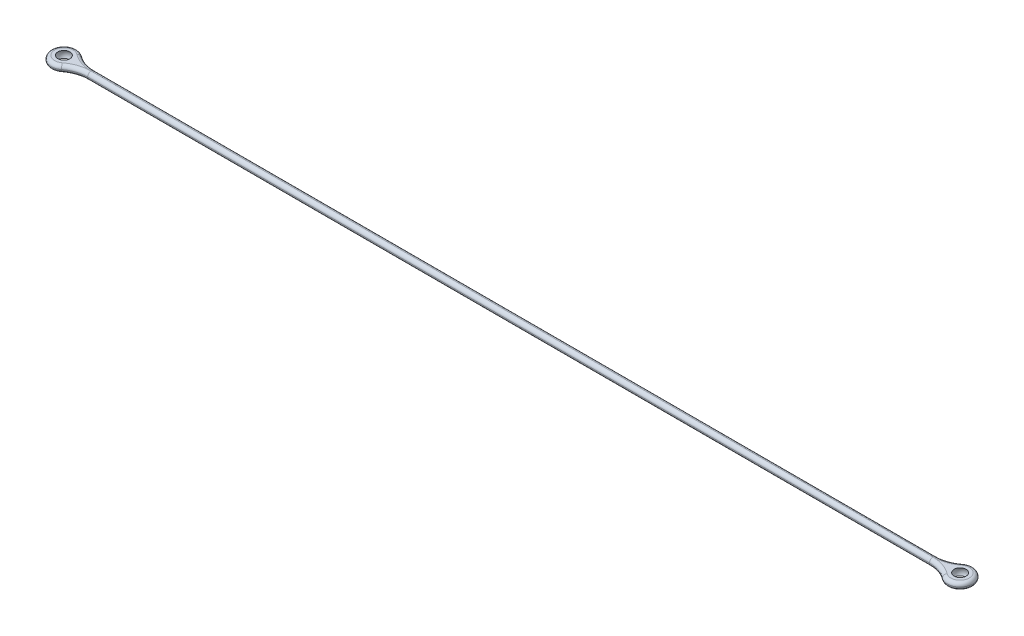
ISO-10303-21;
HEADER;
FILE_DESCRIPTION(('STEP AP214'),'2;1');
FILE_NAME('part.step','',(''),(''),'','','');
FILE_SCHEMA(('AUTOMOTIVE_DESIGN { 1 0 10303 214 1 1 1 1 }'));
ENDSEC;
DATA;
#1=APPLICATION_CONTEXT('core data for automotive mechanical design processes');
#2=APPLICATION_PROTOCOL_DEFINITION('international standard','automotive_design',2000,#1);
#3=PRODUCT_CONTEXT('',#1,'mechanical');
#4=PRODUCT('Part','Part','',(#3));
#5=PRODUCT_RELATED_PRODUCT_CATEGORY('part','',(#4));
#6=PRODUCT_DEFINITION_FORMATION('','',#4);
#7=PRODUCT_DEFINITION_CONTEXT('part definition',#1,'design');
#8=PRODUCT_DEFINITION('design','',#6,#7);
#9=PRODUCT_DEFINITION_SHAPE('','',#8);
#10=(LENGTH_UNIT() NAMED_UNIT(*) SI_UNIT(.MILLI.,.METRE.));
#11=(NAMED_UNIT(*) PLANE_ANGLE_UNIT() SI_UNIT($,.RADIAN.));
#12=(NAMED_UNIT(*) SI_UNIT($,.STERADIAN.) SOLID_ANGLE_UNIT());
#13=UNCERTAINTY_MEASURE_WITH_UNIT(LENGTH_MEASURE(1.E-05),#10,'distance_accuracy_value','');
#14=(GEOMETRIC_REPRESENTATION_CONTEXT(3) GLOBAL_UNCERTAINTY_ASSIGNED_CONTEXT((#13)) GLOBAL_UNIT_ASSIGNED_CONTEXT((#10,
#11,#12)) REPRESENTATION_CONTEXT('',''));
#15=CARTESIAN_POINT('',(0.,0.,0.));
#16=DIRECTION('',(0.,0.,1.));
#17=DIRECTION('',(1.,0.,0.));
#18=AXIS2_PLACEMENT_3D('',#15,#16,#17);
#19=CARTESIAN_POINT('',(-155.619105223023,0.75,0.));
#20=DIRECTION('',(0.,1.,0.));
#21=DIRECTION('',(0.,0.,1.));
#22=AXIS2_PLACEMENT_3D('',#19,#20,#21);
#23=PLANE('',#22);
#24=CARTESIAN_POINT('',(-97.157,0.75,0.));
#25=DIRECTION('',(0.,1.,0.));
#26=DIRECTION('',(0.,0.,1.));
#27=AXIS2_PLACEMENT_3D('',#24,#25,#26);
#28=CIRCLE('',#27,2.00000000000002);
#29=CARTESIAN_POINT('',(-95.9391677734834,0.75,-1.58646924585949));
#30=VERTEX_POINT('',#29);
#31=CARTESIAN_POINT('',(-95.9391677734835,0.75,1.58646924585949));
#32=VERTEX_POINT('',#31);
#33=EDGE_CURVE('E44',#30,#32,#28,.T.);
#34=ORIENTED_EDGE('',*,*,#33,.T.);
#35=CARTESIAN_POINT('',(-91.2670766299833,0.75,7.67279932616727));
#36=DIRECTION('',(0.,1.,0.));
#37=DIRECTION('',(0.,0.,1.));
#38=AXIS2_PLACEMENT_3D('',#35,#36,#37);
#39=CIRCLE('',#38,7.67279932616727);
#40=CARTESIAN_POINT('',(-91.2670766299833,0.75,0.));
#41=VERTEX_POINT('',#40);
#42=EDGE_CURVE('E11',#32,#41,#39,.F.);
#43=ORIENTED_EDGE('',*,*,#42,.T.);
#44=CARTESIAN_POINT('',(-91.2670766299833,0.75,-7.6727993261669));
#45=DIRECTION('',(0.,1.,0.));
#46=DIRECTION('',(0.,0.,1.));
#47=AXIS2_PLACEMENT_3D('',#44,#45,#46);
#48=CIRCLE('',#47,7.67279932616691);
#49=EDGE_CURVE('E121',#41,#30,#48,.F.);
#50=ORIENTED_EDGE('',*,*,#49,.T.);
#51=EDGE_LOOP('',(#34,#43,#50));
#52=FACE_BOUND('',#51,.T.);
#53=CARTESIAN_POINT('',(-97.157,0.75,0.));
#54=DIRECTION('',(0.,1.,0.));
#55=DIRECTION('',(0.,0.,1.));
#56=AXIS2_PLACEMENT_3D('',#53,#54,#55);
#57=CIRCLE('',#56,1.29903810567666);
#58=CARTESIAN_POINT('',(-97.157,0.75,1.29903810567666));
#59=VERTEX_POINT('',#58);
#60=EDGE_CURVE('E167',#59,#59,#57,.T.);
#61=ORIENTED_EDGE('',*,*,#60,.F.);
#62=EDGE_LOOP('',(#61));
#63=FACE_BOUND('',#62,.T.);
#64=ADVANCED_FACE('F34',(#52,#63),#23,.T.);
#65=CARTESIAN_POINT('',(-155.619105223023,-0.75,0.));
#66=DIRECTION('',(0.,1.,0.));
#67=DIRECTION('',(0.,0.,1.));
#68=AXIS2_PLACEMENT_3D('',#65,#66,#67);
#69=PLANE('',#68);
#70=CARTESIAN_POINT('',(-91.2670766299833,-0.75,-7.6727993261669));
#71=DIRECTION('',(0.,1.,0.));
#72=DIRECTION('',(0.,0.,1.));
#73=AXIS2_PLACEMENT_3D('',#70,#71,#72);
#74=CIRCLE('',#73,7.67279932616691);
#75=CARTESIAN_POINT('',(-95.9391677734834,-0.75,-1.58646924585949));
#76=VERTEX_POINT('',#75);
#77=CARTESIAN_POINT('',(-91.2670766299833,-0.75,0.));
#78=VERTEX_POINT('',#77);
#79=EDGE_CURVE('E185',#76,#78,#74,.T.);
#80=ORIENTED_EDGE('',*,*,#79,.T.);
#81=CARTESIAN_POINT('',(-91.2670766299833,-0.75,7.67279932616727));
#82=DIRECTION('',(0.,1.,0.));
#83=DIRECTION('',(0.,0.,1.));
#84=AXIS2_PLACEMENT_3D('',#81,#82,#83);
#85=CIRCLE('',#84,7.67279932616727);
#86=CARTESIAN_POINT('',(-95.9391677734835,-0.75,1.58646924585949));
#87=VERTEX_POINT('',#86);
#88=EDGE_CURVE('E189',#78,#87,#85,.T.);
#89=ORIENTED_EDGE('',*,*,#88,.T.);
#90=CARTESIAN_POINT('',(-97.157,-0.75,0.));
#91=DIRECTION('',(0.,1.,0.));
#92=DIRECTION('',(0.,0.,1.));
#93=AXIS2_PLACEMENT_3D('',#90,#91,#92);
#94=CIRCLE('',#93,2.00000000000002);
#95=EDGE_CURVE('E187',#87,#76,#94,.F.);
#96=ORIENTED_EDGE('',*,*,#95,.T.);
#97=EDGE_LOOP('',(#80,#89,#96));
#98=FACE_BOUND('',#97,.T.);
#99=CARTESIAN_POINT('',(-97.157,-0.75,0.));
#100=DIRECTION('',(0.,1.,0.));
#101=DIRECTION('',(0.,0.,1.));
#102=AXIS2_PLACEMENT_3D('',#99,#100,#101);
#103=CIRCLE('',#102,1.29903810567666);
#104=CARTESIAN_POINT('',(-97.157,-0.75,1.29903810567666));
#105=VERTEX_POINT('',#104);
#106=EDGE_CURVE('E169',#105,#105,#103,.T.);
#107=ORIENTED_EDGE('',*,*,#106,.T.);
#108=EDGE_LOOP('',(#107));
#109=FACE_BOUND('',#108,.T.);
#110=ADVANCED_FACE('F162',(#98,#109),#69,.F.);
#111=CARTESIAN_POINT('',(91.2670766299833,-0.75,7.6727993261673));
#112=DIRECTION('',(0.,1.,0.));
#113=DIRECTION('',(0.,0.,1.));
#114=AXIS2_PLACEMENT_3D('',#111,#112,#113);
#115=CIRCLE('',#114,7.67279932616731);
#116=CARTESIAN_POINT('',(95.9391677734835,-0.75,1.58646924585947));
#117=VERTEX_POINT('',#116);
#118=CARTESIAN_POINT('',(91.2670766299833,-0.75,0.));
#119=VERTEX_POINT('',#118);
#120=EDGE_CURVE('E173',#117,#119,#115,.T.);
#121=ORIENTED_EDGE('',*,*,#120,.T.);
#122=CARTESIAN_POINT('',(91.2670766299833,-0.75,-7.6727993261673));
#123=DIRECTION('',(0.,1.,0.));
#124=DIRECTION('',(0.,0.,1.));
#125=AXIS2_PLACEMENT_3D('',#122,#123,#124);
#126=CIRCLE('',#125,7.67279932616731);
#127=CARTESIAN_POINT('',(95.9391677734835,-0.75,-1.58646924585951));
#128=VERTEX_POINT('',#127);
#129=EDGE_CURVE('E183',#119,#128,#126,.T.);
#130=ORIENTED_EDGE('',*,*,#129,.T.);
#131=CARTESIAN_POINT('',(97.157,-0.75,0.));
#132=DIRECTION('',(0.,1.,0.));
#133=DIRECTION('',(0.,0.,1.));
#134=AXIS2_PLACEMENT_3D('',#131,#132,#133);
#135=CIRCLE('',#134,2.00000000000001);
#136=EDGE_CURVE('E94',#128,#117,#135,.F.);
#137=ORIENTED_EDGE('',*,*,#136,.T.);
#138=EDGE_LOOP('',(#121,#130,#137));
#139=FACE_BOUND('',#138,.T.);
#140=CARTESIAN_POINT('',(97.157,-0.75,0.));
#141=DIRECTION('',(0.,1.,0.));
#142=DIRECTION('',(0.,0.,1.));
#143=AXIS2_PLACEMENT_3D('',#140,#141,#142);
#144=CIRCLE('',#143,1.29903810567666);
#145=CARTESIAN_POINT('',(97.157,-0.75,1.29903810567662));
#146=VERTEX_POINT('',#145);
#147=EDGE_CURVE('E170',#146,#146,#144,.T.);
#148=ORIENTED_EDGE('',*,*,#147,.T.);
#149=EDGE_LOOP('',(#148));
#150=FACE_BOUND('',#149,.T.);
#151=ADVANCED_FACE('F259',(#139,#150),#69,.F.);
#152=CARTESIAN_POINT('',(97.157,0.75,0.));
#153=DIRECTION('',(0.,1.,0.));
#154=DIRECTION('',(0.,0.,1.));
#155=AXIS2_PLACEMENT_3D('',#152,#153,#154);
#156=CIRCLE('',#155,2.00000000000001);
#157=CARTESIAN_POINT('',(95.9391677734835,0.75,1.58646924585947));
#158=VERTEX_POINT('',#157);
#159=CARTESIAN_POINT('',(95.9391677734835,0.75,-1.58646924585951));
#160=VERTEX_POINT('',#159);
#161=EDGE_CURVE('E194',#158,#160,#156,.T.);
#162=ORIENTED_EDGE('',*,*,#161,.T.);
#163=CARTESIAN_POINT('',(91.2670766299833,0.75,-7.6727993261673));
#164=DIRECTION('',(0.,1.,0.));
#165=DIRECTION('',(0.,0.,1.));
#166=AXIS2_PLACEMENT_3D('',#163,#164,#165);
#167=CIRCLE('',#166,7.67279932616731);
#168=CARTESIAN_POINT('',(91.2670766299833,0.75,0.));
#169=VERTEX_POINT('',#168);
#170=EDGE_CURVE('E128',#160,#169,#167,.F.);
#171=ORIENTED_EDGE('',*,*,#170,.T.);
#172=CARTESIAN_POINT('',(91.2670766299833,0.75,7.6727993261673));
#173=DIRECTION('',(0.,1.,0.));
#174=DIRECTION('',(0.,0.,1.));
#175=AXIS2_PLACEMENT_3D('',#172,#173,#174);
#176=CIRCLE('',#175,7.67279932616731);
#177=EDGE_CURVE('E192',#169,#158,#176,.F.);
#178=ORIENTED_EDGE('',*,*,#177,.T.);
#179=EDGE_LOOP('',(#162,#171,#178));
#180=FACE_BOUND('',#179,.T.);
#181=CARTESIAN_POINT('',(97.157,0.75,0.));
#182=DIRECTION('',(0.,1.,0.));
#183=DIRECTION('',(0.,0.,1.));
#184=AXIS2_PLACEMENT_3D('',#181,#182,#183);
#185=CIRCLE('',#184,1.29903810567666);
#186=CARTESIAN_POINT('',(97.157,0.75,1.29903810567662));
#187=VERTEX_POINT('',#186);
#188=EDGE_CURVE('E176',#187,#187,#185,.T.);
#189=ORIENTED_EDGE('',*,*,#188,.F.);
#190=EDGE_LOOP('',(#189));
#191=FACE_BOUND('',#190,.T.);
#192=ADVANCED_FACE('F164',(#180,#191),#23,.T.);
#193=CARTESIAN_POINT('',(-97.157,0.,0.));
#194=DIRECTION('',(-1.,0.,0.));
#195=DIRECTION('',(0.,0.,-1.));
#196=AXIS2_PLACEMENT_3D('',#193,#194,#195);
#197=SPHERICAL_SURFACE('',#196,1.5);
#198=CARTESIAN_POINT('',(-97.157,0.,0.));
#199=DIRECTION('',(0.,1.,0.));
#200=DIRECTION('',(0.,0.,1.));
#201=AXIS2_PLACEMENT_3D('',#198,#199,#200);
#202=SPHERICAL_SURFACE('',#201,1.5);
#203=ORIENTED_EDGE('',*,*,#60,.T.);
#204=EDGE_LOOP('',(#203));
#205=FACE_BOUND('',#204,.T.);
#206=ORIENTED_EDGE('',*,*,#106,.F.);
#207=EDGE_LOOP('',(#206));
#208=FACE_BOUND('',#207,.T.);
#209=ADVANCED_FACE('F258',(#205,#208),#202,.F.);
#210=CARTESIAN_POINT('',(97.157,0.,0.));
#211=DIRECTION('',(-1.,0.,0.));
#212=DIRECTION('',(0.,0.,1.));
#213=AXIS2_PLACEMENT_3D('',#210,#211,#212);
#214=SPHERICAL_SURFACE('',#213,1.5);
#215=CARTESIAN_POINT('',(97.157,0.,0.));
#216=DIRECTION('',(0.,1.,0.));
#217=DIRECTION('',(0.,0.,1.));
#218=AXIS2_PLACEMENT_3D('',#215,#216,#217);
#219=SPHERICAL_SURFACE('',#218,1.5);
#220=ORIENTED_EDGE('',*,*,#188,.T.);
#221=EDGE_LOOP('',(#220));
#222=FACE_BOUND('',#221,.T.);
#223=ORIENTED_EDGE('',*,*,#147,.F.);
#224=EDGE_LOOP('',(#223));
#225=FACE_BOUND('',#224,.T.);
#226=ADVANCED_FACE('F262',(#222,#225),#219,.F.);
#227=CARTESIAN_POINT('',(97.157,0.,0.));
#228=DIRECTION('',(0.,1.,0.));
#229=DIRECTION('',(0.,0.,1.));
#230=AXIS2_PLACEMENT_3D('',#227,#228,#229);
#231=TOROIDAL_SURFACE('',#230,2.00000000000001,0.75);
#232=CARTESIAN_POINT('',(95.9391677734835,0.,-1.58646924585951));
#233=DIRECTION('',(-0.793234622929726,0.,0.608916113258251));
#234=DIRECTION('',(0.608916113258251,0.,0.793234622929726));
#235=AXIS2_PLACEMENT_3D('',#232,#233,#234);
#236=CIRCLE('',#235,0.75);
#237=CARTESIAN_POINT('',(95.4824806885399,0.,-2.18139521305677));
#238=VERTEX_POINT('',#237);
#239=EDGE_CURVE('E38',#160,#238,#236,.T.);
#240=ORIENTED_EDGE('',*,*,#239,.F.);
#241=ORIENTED_EDGE('',*,*,#161,.F.);
#242=CARTESIAN_POINT('',(95.9391677734835,0.,1.58646924585946));
#243=DIRECTION('',(-0.793234622929741,0.,-0.608916113258231));
#244=DIRECTION('',(-0.608916113258231,0.,0.793234622929741));
#245=AXIS2_PLACEMENT_3D('',#242,#243,#244);
#246=CIRCLE('',#245,0.75);
#247=CARTESIAN_POINT('',(95.4824806885399,0.,2.18139521305678));
#248=VERTEX_POINT('',#247);
#249=EDGE_CURVE('E80',#248,#158,#246,.T.);
#250=ORIENTED_EDGE('',*,*,#249,.F.);
#251=CARTESIAN_POINT('',(97.157,0.,0.));
#252=DIRECTION('',(0.,1.,0.));
#253=DIRECTION('',(0.,0.,1.));
#254=AXIS2_PLACEMENT_3D('',#251,#252,#253);
#255=CIRCLE('',#254,2.75000000000001);
#256=EDGE_CURVE('E242',#238,#248,#255,.F.);
#257=ORIENTED_EDGE('',*,*,#256,.F.);
#258=EDGE_LOOP('',(#240,#241,#250,#257));
#259=FACE_BOUND('',#258,.T.);
#260=ADVANCED_FACE('F36',(#259),#231,.T.);
#261=CARTESIAN_POINT('',(91.2670766299833,0.,-7.6727993261673));
#262=DIRECTION('',(0.,1.,0.));
#263=DIRECTION('',(0.,0.,1.));
#264=AXIS2_PLACEMENT_3D('',#261,#262,#263);
#265=TOROIDAL_SURFACE('',#264,7.67279932616731,0.75);
#266=ORIENTED_EDGE('',*,*,#170,.F.);
#267=ORIENTED_EDGE('',*,*,#239,.T.);
#268=CARTESIAN_POINT('',(91.2670766299833,0.,-7.6727993261673));
#269=DIRECTION('',(0.,1.,0.));
#270=DIRECTION('',(0.,0.,1.));
#271=AXIS2_PLACEMENT_3D('',#268,#269,#270);
#272=CIRCLE('',#271,6.92279932616731);
#273=CARTESIAN_POINT('',(91.2670766299833,0.,-0.75));
#274=VERTEX_POINT('',#273);
#275=EDGE_CURVE('E237',#274,#238,#272,.T.);
#276=ORIENTED_EDGE('',*,*,#275,.F.);
#277=CARTESIAN_POINT('',(91.2670766299833,0.,0.));
#278=DIRECTION('',(-1.,0.,0.));
#279=DIRECTION('',(0.,0.,1.));
#280=AXIS2_PLACEMENT_3D('',#277,#278,#279);
#281=CIRCLE('',#280,0.75);
#282=EDGE_CURVE('E140',#169,#274,#281,.T.);
#283=ORIENTED_EDGE('',*,*,#282,.F.);
#284=EDGE_LOOP('',(#266,#267,#276,#283));
#285=FACE_BOUND('',#284,.T.);
#286=ADVANCED_FACE('F254',(#285),#265,.T.);
#287=CARTESIAN_POINT('',(91.2670766299833,0.,7.6727993261673));
#288=DIRECTION('',(0.,1.,0.));
#289=DIRECTION('',(0.,0.,1.));
#290=AXIS2_PLACEMENT_3D('',#287,#288,#289);
#291=TOROIDAL_SURFACE('',#290,7.67279932616731,0.75);
#292=ORIENTED_EDGE('',*,*,#249,.T.);
#293=ORIENTED_EDGE('',*,*,#177,.F.);
#294=CARTESIAN_POINT('',(91.2670766299833,0.,0.));
#295=DIRECTION('',(-1.,0.,0.));
#296=DIRECTION('',(0.,0.,1.));
#297=AXIS2_PLACEMENT_3D('',#294,#295,#296);
#298=CIRCLE('',#297,0.75);
#299=CARTESIAN_POINT('',(91.2670766299833,0.,0.75));
#300=VERTEX_POINT('',#299);
#301=EDGE_CURVE('E148',#300,#169,#298,.T.);
#302=ORIENTED_EDGE('',*,*,#301,.F.);
#303=CARTESIAN_POINT('',(91.2670766299833,0.,7.6727993261673));
#304=DIRECTION('',(0.,1.,0.));
#305=DIRECTION('',(0.,0.,1.));
#306=AXIS2_PLACEMENT_3D('',#303,#304,#305);
#307=CIRCLE('',#306,6.92279932616731);
#308=EDGE_CURVE('E232',#248,#300,#307,.T.);
#309=ORIENTED_EDGE('',*,*,#308,.F.);
#310=EDGE_LOOP('',(#292,#293,#302,#309));
#311=FACE_BOUND('',#310,.T.);
#312=ADVANCED_FACE('F246',(#311),#291,.T.);
#313=CARTESIAN_POINT('',(97.157,0.,0.));
#314=DIRECTION('',(0.,1.,0.));
#315=DIRECTION('',(0.,0.,1.));
#316=AXIS2_PLACEMENT_3D('',#313,#314,#315);
#317=TOROIDAL_SURFACE('',#316,2.00000000000001,0.75);
#318=CARTESIAN_POINT('',(95.9391677734835,0.,1.58646924585946));
#319=DIRECTION('',(-0.793234622929741,0.,-0.608916113258232));
#320=DIRECTION('',(-0.608916113258232,0.,0.793234622929741));
#321=AXIS2_PLACEMENT_3D('',#318,#319,#320);
#322=CIRCLE('',#321,0.75);
#323=EDGE_CURVE('E229',#117,#248,#322,.T.);
#324=ORIENTED_EDGE('',*,*,#323,.F.);
#325=ORIENTED_EDGE('',*,*,#136,.F.);
#326=CARTESIAN_POINT('',(95.9391677734835,0.,-1.58646924585951));
#327=DIRECTION('',(-0.793234622929728,0.,0.608916113258248));
#328=DIRECTION('',(0.608916113258248,0.,0.793234622929728));
#329=AXIS2_PLACEMENT_3D('',#326,#327,#328);
#330=CIRCLE('',#329,0.75);
#331=EDGE_CURVE('E240',#238,#128,#330,.T.);
#332=ORIENTED_EDGE('',*,*,#331,.F.);
#333=ORIENTED_EDGE('',*,*,#256,.T.);
#334=EDGE_LOOP('',(#324,#325,#332,#333));
#335=FACE_BOUND('',#334,.T.);
#336=ADVANCED_FACE('F252',(#335),#317,.T.);
#337=CARTESIAN_POINT('',(91.2670766299833,0.,-7.6727993261673));
#338=DIRECTION('',(0.,1.,0.));
#339=DIRECTION('',(0.,0.,1.));
#340=AXIS2_PLACEMENT_3D('',#337,#338,#339);
#341=TOROIDAL_SURFACE('',#340,7.67279932616731,0.75);
#342=ORIENTED_EDGE('',*,*,#331,.T.);
#343=ORIENTED_EDGE('',*,*,#129,.F.);
#344=CARTESIAN_POINT('',(91.2670766299833,0.,0.));
#345=DIRECTION('',(-1.,0.,0.));
#346=DIRECTION('',(0.,0.,1.));
#347=AXIS2_PLACEMENT_3D('',#344,#345,#346);
#348=CIRCLE('',#347,0.75);
#349=EDGE_CURVE('E226',#274,#119,#348,.T.);
#350=ORIENTED_EDGE('',*,*,#349,.F.);
#351=ORIENTED_EDGE('',*,*,#275,.T.);
#352=EDGE_LOOP('',(#342,#343,#350,#351));
#353=FACE_BOUND('',#352,.T.);
#354=ADVANCED_FACE('F310',(#353),#341,.T.);
#355=CARTESIAN_POINT('',(-155.619105223023,0.,0.));
#356=DIRECTION('',(-1.,0.,0.));
#357=DIRECTION('',(0.,0.,1.));
#358=AXIS2_PLACEMENT_3D('',#355,#356,#357);
#359=CYLINDRICAL_SURFACE('',#358,0.75);
#360=CARTESIAN_POINT('',(-91.2670766299833,0.,0.));
#361=DIRECTION('',(-1.,0.,0.));
#362=DIRECTION('',(0.,0.,1.));
#363=AXIS2_PLACEMENT_3D('',#360,#361,#362);
#364=CIRCLE('',#363,0.75);
#365=CARTESIAN_POINT('',(-91.2670766299833,0.,-0.74999999999999));
#366=VERTEX_POINT('',#365);
#367=EDGE_CURVE('E124',#41,#366,#364,.T.);
#368=ORIENTED_EDGE('',*,*,#367,.F.);
#369=DIRECTION('',(1.,0.,0.));
#370=VECTOR('',#369,1.);
#371=CARTESIAN_POINT('',(-91.2670766299833,0.75,0.));
#372=LINE('',#371,#370);
#373=EDGE_CURVE('E135',#169,#41,#372,.F.);
#374=ORIENTED_EDGE('',*,*,#373,.F.);
#375=ORIENTED_EDGE('',*,*,#282,.T.);
#376=DIRECTION('',(1.,0.,0.));
#377=VECTOR('',#376,1.);
#378=CARTESIAN_POINT('',(91.2670766299833,0.,-0.75));
#379=LINE('',#378,#377);
#380=EDGE_CURVE('E138',#366,#274,#379,.T.);
#381=ORIENTED_EDGE('',*,*,#380,.F.);
#382=EDGE_LOOP('',(#368,#374,#375,#381));
#383=FACE_BOUND('',#382,.T.);
#384=ADVANCED_FACE('F133',(#383),#359,.T.);
#385=CARTESIAN_POINT('',(-91.2670766299833,0.,-7.6727993261669));
#386=DIRECTION('',(0.,1.,0.));
#387=DIRECTION('',(0.,0.,1.));
#388=AXIS2_PLACEMENT_3D('',#385,#386,#387);
#389=TOROIDAL_SURFACE('',#388,7.67279932616691,0.75);
#390=ORIENTED_EDGE('',*,*,#49,.F.);
#391=ORIENTED_EDGE('',*,*,#367,.T.);
#392=CARTESIAN_POINT('',(-91.2670766299833,0.,-7.6727993261669));
#393=DIRECTION('',(0.,1.,0.));
#394=DIRECTION('',(0.,0.,1.));
#395=AXIS2_PLACEMENT_3D('',#392,#393,#394);
#396=CIRCLE('',#395,6.92279932616691);
#397=CARTESIAN_POINT('',(-95.4824806885398,0.,-2.18139521305675));
#398=VERTEX_POINT('',#397);
#399=EDGE_CURVE('E219',#398,#366,#396,.T.);
#400=ORIENTED_EDGE('',*,*,#399,.F.);
#401=CARTESIAN_POINT('',(-95.9391677734834,0.,-1.58646924585949));
#402=DIRECTION('',(-0.793234622929721,0.,-0.608916113258258));
#403=DIRECTION('',(-0.608916113258258,0.,0.793234622929721));
#404=AXIS2_PLACEMENT_3D('',#401,#402,#403);
#405=CIRCLE('',#404,0.75);
#406=EDGE_CURVE('E127',#30,#398,#405,.T.);
#407=ORIENTED_EDGE('',*,*,#406,.F.);
#408=EDGE_LOOP('',(#390,#391,#400,#407));
#409=FACE_BOUND('',#408,.T.);
#410=ADVANCED_FACE('F123',(#409),#389,.T.);
#411=CARTESIAN_POINT('',(-155.619105223023,0.,0.));
#412=DIRECTION('',(1.,0.,0.));
#413=DIRECTION('',(0.,0.,-1.));
#414=AXIS2_PLACEMENT_3D('',#411,#412,#413);
#415=CYLINDRICAL_SURFACE('',#414,0.75);
#416=ORIENTED_EDGE('',*,*,#301,.T.);
#417=ORIENTED_EDGE('',*,*,#373,.T.);
#418=CARTESIAN_POINT('',(-91.2670766299833,0.,0.));
#419=DIRECTION('',(-1.,0.,0.));
#420=DIRECTION('',(0.,0.,1.));
#421=AXIS2_PLACEMENT_3D('',#418,#419,#420);
#422=CIRCLE('',#421,0.75);
#423=CARTESIAN_POINT('',(-91.2670766299833,0.,0.749999999999999));
#424=VERTEX_POINT('',#423);
#425=EDGE_CURVE('E146',#424,#41,#422,.T.);
#426=ORIENTED_EDGE('',*,*,#425,.F.);
#427=DIRECTION('',(1.,0.,0.));
#428=VECTOR('',#427,1.);
#429=CARTESIAN_POINT('',(-155.619105223023,0.,0.75));
#430=LINE('',#429,#428);
#431=EDGE_CURVE('E158',#300,#424,#430,.F.);
#432=ORIENTED_EDGE('',*,*,#431,.F.);
#433=EDGE_LOOP('',(#416,#417,#426,#432));
#434=FACE_BOUND('',#433,.T.);
#435=ADVANCED_FACE('F144',(#434),#415,.T.);
#436=CARTESIAN_POINT('',(91.2670766299833,0.,7.6727993261673));
#437=DIRECTION('',(0.,1.,0.));
#438=DIRECTION('',(0.,0.,1.));
#439=AXIS2_PLACEMENT_3D('',#436,#437,#438);
#440=TOROIDAL_SURFACE('',#439,7.67279932616731,0.75);
#441=ORIENTED_EDGE('',*,*,#323,.T.);
#442=ORIENTED_EDGE('',*,*,#308,.T.);
#443=CARTESIAN_POINT('',(91.2670766299833,0.,0.));
#444=DIRECTION('',(-1.,0.,0.));
#445=DIRECTION('',(0.,0.,1.));
#446=AXIS2_PLACEMENT_3D('',#443,#444,#445);
#447=CIRCLE('',#446,0.75);
#448=EDGE_CURVE('E213',#119,#300,#447,.T.);
#449=ORIENTED_EDGE('',*,*,#448,.F.);
#450=ORIENTED_EDGE('',*,*,#120,.F.);
#451=EDGE_LOOP('',(#441,#442,#449,#450));
#452=FACE_BOUND('',#451,.T.);
#453=ADVANCED_FACE('F250',(#452),#440,.T.);
#454=CARTESIAN_POINT('',(-155.619105223023,0.,0.));
#455=DIRECTION('',(1.,0.,0.));
#456=DIRECTION('',(0.,0.,-1.));
#457=AXIS2_PLACEMENT_3D('',#454,#455,#456);
#458=CYLINDRICAL_SURFACE('',#457,0.75);
#459=DIRECTION('',(1.,0.,0.));
#460=VECTOR('',#459,1.);
#461=CARTESIAN_POINT('',(-155.619105223023,-0.75,0.));
#462=LINE('',#461,#460);
#463=EDGE_CURVE('E210',#78,#119,#462,.T.);
#464=ORIENTED_EDGE('',*,*,#463,.F.);
#465=CARTESIAN_POINT('',(-91.2670766299833,0.,0.));
#466=DIRECTION('',(-1.,0.,0.));
#467=DIRECTION('',(0.,0.,1.));
#468=AXIS2_PLACEMENT_3D('',#465,#466,#467);
#469=CIRCLE('',#468,0.75);
#470=EDGE_CURVE('E222',#366,#78,#469,.T.);
#471=ORIENTED_EDGE('',*,*,#470,.F.);
#472=ORIENTED_EDGE('',*,*,#380,.T.);
#473=ORIENTED_EDGE('',*,*,#349,.T.);
#474=EDGE_LOOP('',(#464,#471,#472,#473));
#475=FACE_BOUND('',#474,.T.);
#476=ADVANCED_FACE('F297',(#475),#458,.T.);
#477=CARTESIAN_POINT('',(-91.2670766299833,0.,-7.6727993261669));
#478=DIRECTION('',(0.,1.,0.));
#479=DIRECTION('',(0.,0.,1.));
#480=AXIS2_PLACEMENT_3D('',#477,#478,#479);
#481=TOROIDAL_SURFACE('',#480,7.67279932616691,0.75);
#482=ORIENTED_EDGE('',*,*,#470,.T.);
#483=ORIENTED_EDGE('',*,*,#79,.F.);
#484=CARTESIAN_POINT('',(-95.9391677734834,0.,-1.58646924585948));
#485=DIRECTION('',(-0.793234622929724,0.,-0.608916113258254));
#486=DIRECTION('',(-0.608916113258254,0.,0.793234622929724));
#487=AXIS2_PLACEMENT_3D('',#484,#485,#486);
#488=CIRCLE('',#487,0.75);
#489=EDGE_CURVE('E207',#398,#76,#488,.T.);
#490=ORIENTED_EDGE('',*,*,#489,.F.);
#491=ORIENTED_EDGE('',*,*,#399,.T.);
#492=EDGE_LOOP('',(#482,#483,#490,#491));
#493=FACE_BOUND('',#492,.T.);
#494=ADVANCED_FACE('F293',(#493),#481,.T.);
#495=CARTESIAN_POINT('',(-97.157,0.,0.));
#496=DIRECTION('',(0.,1.,0.));
#497=DIRECTION('',(0.,0.,1.));
#498=AXIS2_PLACEMENT_3D('',#495,#496,#497);
#499=TOROIDAL_SURFACE('',#498,2.00000000000002,0.75);
#500=CARTESIAN_POINT('',(-95.9391677734835,0.,1.58646924585949));
#501=DIRECTION('',(0.793234622929726,0.,-0.608916113258251));
#502=DIRECTION('',(-0.608916113258251,0.,-0.793234622929726));
#503=AXIS2_PLACEMENT_3D('',#500,#501,#502);
#504=CIRCLE('',#503,0.75);
#505=CARTESIAN_POINT('',(-95.4824806885398,0.,2.18139521305677));
#506=VERTEX_POINT('',#505);
#507=EDGE_CURVE('E157',#32,#506,#504,.T.);
#508=ORIENTED_EDGE('',*,*,#507,.F.);
#509=ORIENTED_EDGE('',*,*,#33,.F.);
#510=ORIENTED_EDGE('',*,*,#406,.T.);
#511=CARTESIAN_POINT('',(-97.157,0.,0.));
#512=DIRECTION('',(0.,1.,0.));
#513=DIRECTION('',(0.,0.,1.));
#514=AXIS2_PLACEMENT_3D('',#511,#512,#513);
#515=CIRCLE('',#514,2.75000000000002);
#516=EDGE_CURVE('E204',#506,#398,#515,.F.);
#517=ORIENTED_EDGE('',*,*,#516,.F.);
#518=EDGE_LOOP('',(#508,#509,#510,#517));
#519=FACE_BOUND('',#518,.T.);
#520=ADVANCED_FACE('F290',(#519),#499,.T.);
#521=CARTESIAN_POINT('',(-91.2670766299833,0.,7.67279932616727));
#522=DIRECTION('',(0.,1.,0.));
#523=DIRECTION('',(0.,0.,1.));
#524=AXIS2_PLACEMENT_3D('',#521,#522,#523);
#525=TOROIDAL_SURFACE('',#524,7.67279932616727,0.75);
#526=ORIENTED_EDGE('',*,*,#42,.F.);
#527=ORIENTED_EDGE('',*,*,#507,.T.);
#528=CARTESIAN_POINT('',(-91.2670766299833,0.,7.67279932616727));
#529=DIRECTION('',(0.,1.,0.));
#530=DIRECTION('',(0.,0.,1.));
#531=AXIS2_PLACEMENT_3D('',#528,#529,#530);
#532=CIRCLE('',#531,6.92279932616727);
#533=EDGE_CURVE('E155',#424,#506,#532,.T.);
#534=ORIENTED_EDGE('',*,*,#533,.F.);
#535=ORIENTED_EDGE('',*,*,#425,.T.);
#536=EDGE_LOOP('',(#526,#527,#534,#535));
#537=FACE_BOUND('',#536,.T.);
#538=ADVANCED_FACE('F153',(#537),#525,.T.);
#539=CARTESIAN_POINT('',(-155.619105223023,0.,0.));
#540=DIRECTION('',(-1.,0.,0.));
#541=DIRECTION('',(0.,0.,1.));
#542=AXIS2_PLACEMENT_3D('',#539,#540,#541);
#543=CYLINDRICAL_SURFACE('',#542,0.75);
#544=ORIENTED_EDGE('',*,*,#448,.T.);
#545=ORIENTED_EDGE('',*,*,#431,.T.);
#546=CARTESIAN_POINT('',(-91.2670766299833,0.,0.));
#547=DIRECTION('',(-1.,0.,0.));
#548=DIRECTION('',(0.,0.,1.));
#549=AXIS2_PLACEMENT_3D('',#546,#547,#548);
#550=CIRCLE('',#549,0.75);
#551=EDGE_CURVE('E201',#78,#424,#550,.T.);
#552=ORIENTED_EDGE('',*,*,#551,.F.);
#553=ORIENTED_EDGE('',*,*,#463,.T.);
#554=EDGE_LOOP('',(#544,#545,#552,#553));
#555=FACE_BOUND('',#554,.T.);
#556=ADVANCED_FACE('F283',(#555),#543,.T.);
#557=CARTESIAN_POINT('',(-97.157,0.,0.));
#558=DIRECTION('',(0.,1.,0.));
#559=DIRECTION('',(0.,0.,1.));
#560=AXIS2_PLACEMENT_3D('',#557,#558,#559);
#561=TOROIDAL_SURFACE('',#560,2.00000000000002,0.75);
#562=ORIENTED_EDGE('',*,*,#489,.T.);
#563=ORIENTED_EDGE('',*,*,#95,.F.);
#564=CARTESIAN_POINT('',(-95.9391677734835,0.,1.58646924585949));
#565=DIRECTION('',(0.793234622929738,0.,-0.608916113258235));
#566=DIRECTION('',(-0.608916113258236,0.,-0.793234622929738));
#567=AXIS2_PLACEMENT_3D('',#564,#565,#566);
#568=CIRCLE('',#567,0.75);
#569=EDGE_CURVE('E199',#506,#87,#568,.T.);
#570=ORIENTED_EDGE('',*,*,#569,.F.);
#571=ORIENTED_EDGE('',*,*,#516,.T.);
#572=EDGE_LOOP('',(#562,#563,#570,#571));
#573=FACE_BOUND('',#572,.T.);
#574=ADVANCED_FACE('F279',(#573),#561,.T.);
#575=CARTESIAN_POINT('',(-91.2670766299833,0.,7.67279932616727));
#576=DIRECTION('',(0.,1.,0.));
#577=DIRECTION('',(0.,0.,1.));
#578=AXIS2_PLACEMENT_3D('',#575,#576,#577);
#579=TOROIDAL_SURFACE('',#578,7.67279932616727,0.75);
#580=ORIENTED_EDGE('',*,*,#551,.T.);
#581=ORIENTED_EDGE('',*,*,#533,.T.);
#582=ORIENTED_EDGE('',*,*,#569,.T.);
#583=ORIENTED_EDGE('',*,*,#88,.F.);
#584=EDGE_LOOP('',(#580,#581,#582,#583));
#585=FACE_BOUND('',#584,.T.);
#586=ADVANCED_FACE('F276',(#585),#579,.T.);
#587=CLOSED_SHELL('',(#64,#110,#151,#192,#209,#226,#260,#286,#312,#336,#354,#384,#410,#435,#453,
#476,#494,#520,#538,#556,#574,#586));
#588=MANIFOLD_SOLID_BREP('B2',#587);
#589=ADVANCED_BREP_SHAPE_REPRESENTATION('',(#18,#588),#14);
#590=SHAPE_DEFINITION_REPRESENTATION(#9,#589);
ENDSEC;
END-ISO-10303-21;
